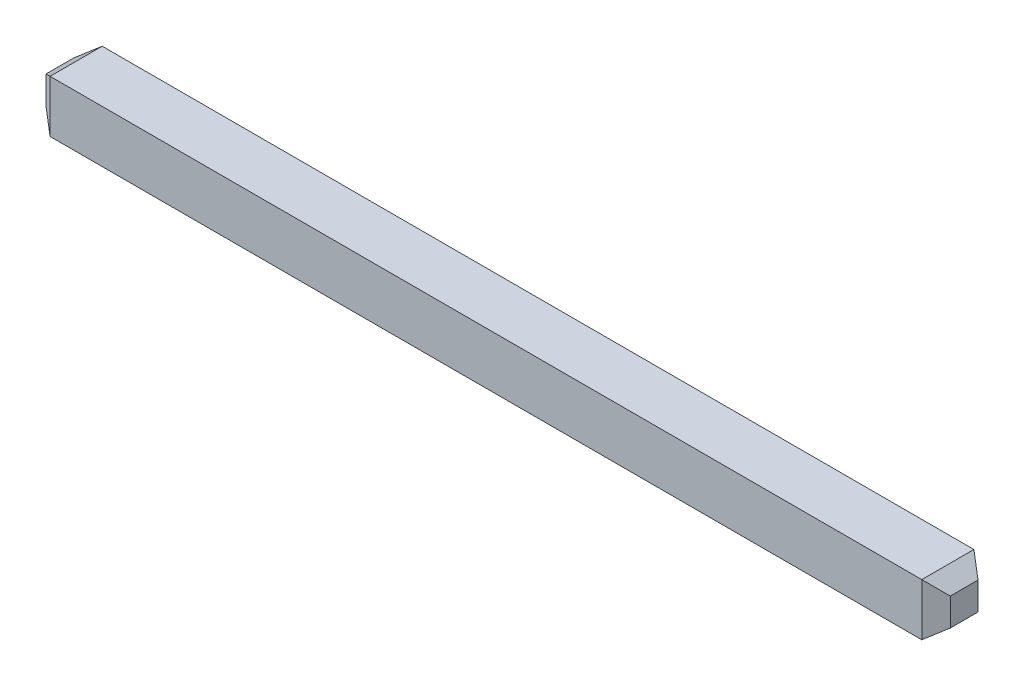
ISO-10303-21;
HEADER;
FILE_DESCRIPTION(('STEP AP214'),'2;1');
FILE_NAME('part.step','',(''),(''),'','','');
FILE_SCHEMA(('AUTOMOTIVE_DESIGN { 1 0 10303 214 1 1 1 1 }'));
ENDSEC;
DATA;
#1=APPLICATION_CONTEXT('core data for automotive mechanical design processes');
#2=APPLICATION_PROTOCOL_DEFINITION('international standard','automotive_design',2000,#1);
#3=PRODUCT_CONTEXT('',#1,'mechanical');
#4=PRODUCT('Part','Part','',(#3));
#5=PRODUCT_RELATED_PRODUCT_CATEGORY('part','',(#4));
#6=PRODUCT_DEFINITION_FORMATION('','',#4);
#7=PRODUCT_DEFINITION_CONTEXT('part definition',#1,'design');
#8=PRODUCT_DEFINITION('design','',#6,#7);
#9=PRODUCT_DEFINITION_SHAPE('','',#8);
#10=(LENGTH_UNIT() NAMED_UNIT(*) SI_UNIT(.MILLI.,.METRE.));
#11=(NAMED_UNIT(*) PLANE_ANGLE_UNIT() SI_UNIT($,.RADIAN.));
#12=(NAMED_UNIT(*) SI_UNIT($,.STERADIAN.) SOLID_ANGLE_UNIT());
#13=UNCERTAINTY_MEASURE_WITH_UNIT(LENGTH_MEASURE(1.E-05),#10,'distance_accuracy_value','');
#14=(GEOMETRIC_REPRESENTATION_CONTEXT(3) GLOBAL_UNCERTAINTY_ASSIGNED_CONTEXT((#13)) GLOBAL_UNIT_ASSIGNED_CONTEXT((#10,
#11,#12)) REPRESENTATION_CONTEXT('',''));
#15=CARTESIAN_POINT('',(0.,0.,0.));
#16=DIRECTION('',(0.,0.,1.));
#17=DIRECTION('',(1.,0.,0.));
#18=AXIS2_PLACEMENT_3D('',#15,#16,#17);
#19=CARTESIAN_POINT('',(-2.4,1.23,-24.375));
#20=DIRECTION('',(0.599999999990736,0.,0.800000000006948));
#21=DIRECTION('',(0.800000000006948,0.,-0.599999999990736));
#22=AXIS2_PLACEMENT_3D('',#19,#20,#21);
#23=PLANE('',#22);
#24=DIRECTION('',(0.,1.,0.));
#25=VECTOR('',#24,1.);
#26=CARTESIAN_POINT('',(-2.3,1.23,-24.45));
#27=LINE('',#26,#25);
#28=CARTESIAN_POINT('',(-2.29999999999957,1.55,-24.4499999999994));
#29=VERTEX_POINT('',#28);
#30=CARTESIAN_POINT('',(-2.29999999999958,0.909999999999898,-24.4499999999994));
#31=VERTEX_POINT('',#30);
#32=EDGE_CURVE('E101',#29,#31,#27,.F.);
#33=ORIENTED_EDGE('',*,*,#32,.T.);
#34=DIRECTION('',(-0.685994340569495,0.514495755428344,0.514495755427429));
#35=VECTOR('',#34,1.);
#36=CARTESIAN_POINT('',(-2.30000000000009,0.909999999999786,-24.45));
#37=LINE('',#36,#35);
#38=CARTESIAN_POINT('',(-2.50000000000021,1.06000000000001,-24.3000000000003));
#39=VERTEX_POINT('',#38);
#40=EDGE_CURVE('E85',#31,#39,#37,.T.);
#41=ORIENTED_EDGE('',*,*,#40,.T.);
#42=DIRECTION('',(0.,1.,0.));
#43=VECTOR('',#42,1.);
#44=CARTESIAN_POINT('',(-2.5,1.23,-24.3));
#45=LINE('',#44,#43);
#46=CARTESIAN_POINT('',(-2.50000000000043,1.4,-24.3000000000006));
#47=VERTEX_POINT('',#46);
#48=EDGE_CURVE('E79',#39,#47,#45,.T.);
#49=ORIENTED_EDGE('',*,*,#48,.T.);
#50=DIRECTION('',(-0.685994340570038,-0.514495755427529,0.51449575542752));
#51=VECTOR('',#50,1.);
#52=CARTESIAN_POINT('',(-2.3,1.55,-24.45));
#53=LINE('',#52,#51);
#54=EDGE_CURVE('E20',#29,#47,#53,.T.);
#55=ORIENTED_EDGE('',*,*,#54,.F.);
#56=EDGE_LOOP('',(#33,#41,#49,#55));
#57=FACE_BOUND('',#56,.T.);
#58=ADVANCED_FACE('F17',(#57),#23,.F.);
#59=CARTESIAN_POINT('',(8.5,1.23,-24.375));
#60=DIRECTION('',(-0.599999999990736,0.,0.800000000006948));
#61=DIRECTION('',(0.800000000006948,0.,0.599999999990736));
#62=AXIS2_PLACEMENT_3D('',#59,#60,#61);
#63=PLANE('',#62);
#64=DIRECTION('',(0.,1.,0.));
#65=VECTOR('',#64,1.);
#66=CARTESIAN_POINT('',(8.6,1.23,-24.3));
#67=LINE('',#66,#65);
#68=CARTESIAN_POINT('',(8.6000000000002,1.06000000000003,-24.3000000000003));
#69=VERTEX_POINT('',#68);
#70=CARTESIAN_POINT('',(8.60000000000043,1.4,-24.3000000000006));
#71=VERTEX_POINT('',#70);
#72=EDGE_CURVE('E113',#69,#71,#67,.T.);
#73=ORIENTED_EDGE('',*,*,#72,.F.);
#74=DIRECTION('',(-0.685994340569496,-0.514495755428343,-0.514495755427429));
#75=VECTOR('',#74,1.);
#76=CARTESIAN_POINT('',(8.59999999999996,1.06000000000005,-24.3));
#77=LINE('',#76,#75);
#78=CARTESIAN_POINT('',(8.39999999999959,0.909999999999884,-24.4499999999994));
#79=VERTEX_POINT('',#78);
#80=EDGE_CURVE('E108',#69,#79,#77,.T.);
#81=ORIENTED_EDGE('',*,*,#80,.T.);
#82=DIRECTION('',(0.,1.,0.));
#83=VECTOR('',#82,1.);
#84=CARTESIAN_POINT('',(8.4,1.23,-24.45));
#85=LINE('',#84,#83);
#86=CARTESIAN_POINT('',(8.39999999999957,1.55,-24.4499999999994));
#87=VERTEX_POINT('',#86);
#88=EDGE_CURVE('E99',#79,#87,#85,.T.);
#89=ORIENTED_EDGE('',*,*,#88,.T.);
#90=DIRECTION('',(-0.685994340570037,0.514495755427528,-0.514495755427522));
#91=VECTOR('',#90,1.);
#92=CARTESIAN_POINT('',(8.6,1.4,-24.3));
#93=LINE('',#92,#91);
#94=EDGE_CURVE('E116',#71,#87,#93,.T.);
#95=ORIENTED_EDGE('',*,*,#94,.F.);
#96=EDGE_LOOP('',(#73,#81,#89,#95));
#97=FACE_BOUND('',#96,.T.);
#98=ADVANCED_FACE('F214',(#97),#63,.F.);
#99=CARTESIAN_POINT('',(-2.4,1.475,-24.13));
#100=DIRECTION('',(-0.6,0.8,0.));
#101=DIRECTION('',(-0.8,-0.6,0.));
#102=AXIS2_PLACEMENT_3D('',#99,#100,#101);
#103=PLANE('',#102);
#104=DIRECTION('',(-0.685994340575954,-0.514495755427525,-0.514495755419637));
#105=VECTOR('',#104,1.);
#106=CARTESIAN_POINT('',(-2.29999999999914,1.55,-23.8100000000012));
#107=LINE('',#106,#105);
#108=CARTESIAN_POINT('',(-2.29999999999989,1.55,-23.8100000000001));
#109=VERTEX_POINT('',#108);
#110=CARTESIAN_POINT('',(-2.50000000000022,1.4,-23.9599999999997));
#111=VERTEX_POINT('',#110);
#112=EDGE_CURVE('E128',#109,#111,#107,.T.);
#113=ORIENTED_EDGE('',*,*,#112,.F.);
#114=DIRECTION('',(0.,0.,1.));
#115=VECTOR('',#114,1.);
#116=CARTESIAN_POINT('',(-2.3,1.55,-24.13));
#117=LINE('',#116,#115);
#118=EDGE_CURVE('E93',#29,#109,#117,.T.);
#119=ORIENTED_EDGE('',*,*,#118,.F.);
#120=ORIENTED_EDGE('',*,*,#54,.T.);
#121=DIRECTION('',(0.,0.,-1.));
#122=VECTOR('',#121,1.);
#123=CARTESIAN_POINT('',(-2.5,1.4,-24.13));
#124=LINE('',#123,#122);
#125=EDGE_CURVE('E87',#47,#111,#124,.F.);
#126=ORIENTED_EDGE('',*,*,#125,.T.);
#127=EDGE_LOOP('',(#113,#119,#120,#126));
#128=FACE_BOUND('',#127,.T.);
#129=ADVANCED_FACE('F90',(#128),#103,.T.);
#130=CARTESIAN_POINT('',(-2.5,1.23,-24.13));
#131=DIRECTION('',(1.,0.,0.));
#132=DIRECTION('',(0.,0.,-1.));
#133=AXIS2_PLACEMENT_3D('',#130,#131,#132);
#134=PLANE('',#133);
#135=DIRECTION('',(0.,1.,0.));
#136=VECTOR('',#135,1.);
#137=CARTESIAN_POINT('',(-2.50000000000086,1.23,-23.9599999999989));
#138=LINE('',#137,#136);
#139=CARTESIAN_POINT('',(-2.50000000000021,1.06000000000001,-23.9599999999997));
#140=VERTEX_POINT('',#139);
#141=EDGE_CURVE('E97',#111,#140,#138,.F.);
#142=ORIENTED_EDGE('',*,*,#141,.F.);
#143=ORIENTED_EDGE('',*,*,#125,.F.);
#144=ORIENTED_EDGE('',*,*,#48,.F.);
#145=DIRECTION('',(0.,0.,1.));
#146=VECTOR('',#145,1.);
#147=CARTESIAN_POINT('',(-2.49999999999996,1.06000000000005,-24.13));
#148=LINE('',#147,#146);
#149=EDGE_CURVE('E105',#39,#140,#148,.T.);
#150=ORIENTED_EDGE('',*,*,#149,.T.);
#151=EDGE_LOOP('',(#142,#143,#144,#150));
#152=FACE_BOUND('',#151,.T.);
#153=ADVANCED_FACE('F95',(#152),#134,.F.);
#154=CARTESIAN_POINT('',(3.05,1.23,-24.45));
#155=DIRECTION('',(0.,0.,1.));
#156=DIRECTION('',(1.,0.,0.));
#157=AXIS2_PLACEMENT_3D('',#154,#155,#156);
#158=PLANE('',#157);
#159=ORIENTED_EDGE('',*,*,#32,.F.);
#160=DIRECTION('',(1.,0.,0.));
#161=VECTOR('',#160,1.);
#162=CARTESIAN_POINT('',(3.05,1.55,-24.45));
#163=LINE('',#162,#161);
#164=EDGE_CURVE('E122',#87,#29,#163,.F.);
#165=ORIENTED_EDGE('',*,*,#164,.F.);
#166=ORIENTED_EDGE('',*,*,#88,.F.);
#167=DIRECTION('',(1.,0.,0.));
#168=VECTOR('',#167,1.);
#169=CARTESIAN_POINT('',(3.05,0.91,-24.45));
#170=LINE('',#169,#168);
#171=EDGE_CURVE('E136',#79,#31,#170,.F.);
#172=ORIENTED_EDGE('',*,*,#171,.T.);
#173=EDGE_LOOP('',(#159,#165,#166,#172));
#174=FACE_BOUND('',#173,.T.);
#175=ADVANCED_FACE('F182',(#174),#158,.F.);
#176=CARTESIAN_POINT('',(-2.4,0.9849999999999,-24.13));
#177=DIRECTION('',(0.600000000000912,0.799999999999316,0.));
#178=DIRECTION('',(-0.799999999999316,0.600000000000912,0.));
#179=AXIS2_PLACEMENT_3D('',#176,#177,#178);
#180=PLANE('',#179);
#181=DIRECTION('',(0.,0.,1.));
#182=VECTOR('',#181,1.);
#183=CARTESIAN_POINT('',(-2.3,0.91,-24.13));
#184=LINE('',#183,#182);
#185=CARTESIAN_POINT('',(-2.29999999999983,0.909999999999856,-23.8100000000003));
#186=VERTEX_POINT('',#185);
#187=EDGE_CURVE('E139',#31,#186,#184,.T.);
#188=ORIENTED_EDGE('',*,*,#187,.T.);
#189=DIRECTION('',(0.685994340575833,-0.514495755427777,0.514495755419546));
#190=VECTOR('',#189,1.);
#191=CARTESIAN_POINT('',(-2.50000000000086,1.06,-23.9599999999989));
#192=LINE('',#191,#190);
#193=EDGE_CURVE('E131',#140,#186,#192,.T.);
#194=ORIENTED_EDGE('',*,*,#193,.F.);
#195=ORIENTED_EDGE('',*,*,#149,.F.);
#196=ORIENTED_EDGE('',*,*,#40,.F.);
#197=EDGE_LOOP('',(#188,#194,#195,#196));
#198=FACE_BOUND('',#197,.T.);
#199=ADVANCED_FACE('F179',(#198),#180,.F.);
#200=CARTESIAN_POINT('',(8.5,0.9849999999999,-24.13));
#201=DIRECTION('',(-0.600000000000912,0.799999999999316,0.));
#202=DIRECTION('',(-0.799999999999316,-0.600000000000912,0.));
#203=AXIS2_PLACEMENT_3D('',#200,#201,#202);
#204=PLANE('',#203);
#205=DIRECTION('',(0.,0.,-1.));
#206=VECTOR('',#205,1.);
#207=CARTESIAN_POINT('',(8.6,1.06,-24.13));
#208=LINE('',#207,#206);
#209=CARTESIAN_POINT('',(8.6000000000002,1.06000000000003,-23.9599999999997));
#210=VERTEX_POINT('',#209);
#211=EDGE_CURVE('E110',#210,#69,#208,.T.);
#212=ORIENTED_EDGE('',*,*,#211,.F.);
#213=DIRECTION('',(0.685994340575833,0.514495755427777,-0.514495755419546));
#214=VECTOR('',#213,1.);
#215=CARTESIAN_POINT('',(8.39999999999914,0.9099999999999,-23.8100000000012));
#216=LINE('',#215,#214);
#217=CARTESIAN_POINT('',(8.39999999999993,0.909999999999868,-23.8100000000001));
#218=VERTEX_POINT('',#217);
#219=EDGE_CURVE('E35',#218,#210,#216,.T.);
#220=ORIENTED_EDGE('',*,*,#219,.F.);
#221=DIRECTION('',(0.,0.,1.));
#222=VECTOR('',#221,1.);
#223=CARTESIAN_POINT('',(8.4,0.91,-24.13));
#224=LINE('',#223,#222);
#225=EDGE_CURVE('E134',#218,#79,#224,.F.);
#226=ORIENTED_EDGE('',*,*,#225,.T.);
#227=ORIENTED_EDGE('',*,*,#80,.F.);
#228=EDGE_LOOP('',(#212,#220,#226,#227));
#229=FACE_BOUND('',#228,.T.);
#230=ADVANCED_FACE('F181',(#229),#204,.F.);
#231=CARTESIAN_POINT('',(8.6,1.23,-24.13));
#232=DIRECTION('',(1.,0.,0.));
#233=DIRECTION('',(0.,0.,-1.));
#234=AXIS2_PLACEMENT_3D('',#231,#232,#233);
#235=PLANE('',#234);
#236=ORIENTED_EDGE('',*,*,#72,.T.);
#237=DIRECTION('',(0.,0.,1.));
#238=VECTOR('',#237,1.);
#239=CARTESIAN_POINT('',(8.6,1.4,-24.13));
#240=LINE('',#239,#238);
#241=CARTESIAN_POINT('',(8.60000000000021,1.4,-23.9599999999997));
#242=VERTEX_POINT('',#241);
#243=EDGE_CURVE('E119',#242,#71,#240,.F.);
#244=ORIENTED_EDGE('',*,*,#243,.F.);
#245=DIRECTION('',(0.,1.,0.));
#246=VECTOR('',#245,1.);
#247=CARTESIAN_POINT('',(8.60000000000086,1.23,-23.9599999999989));
#248=LINE('',#247,#246);
#249=EDGE_CURVE('E142',#210,#242,#248,.T.);
#250=ORIENTED_EDGE('',*,*,#249,.F.);
#251=ORIENTED_EDGE('',*,*,#211,.T.);
#252=EDGE_LOOP('',(#236,#244,#250,#251));
#253=FACE_BOUND('',#252,.T.);
#254=ADVANCED_FACE('F189',(#253),#235,.T.);
#255=CARTESIAN_POINT('',(8.5,1.475,-24.13));
#256=DIRECTION('',(0.6,0.8,0.));
#257=DIRECTION('',(-0.8,0.6,0.));
#258=AXIS2_PLACEMENT_3D('',#255,#256,#257);
#259=PLANE('',#258);
#260=DIRECTION('',(-0.685994340575954,0.514495755427525,0.514495755419637));
#261=VECTOR('',#260,1.);
#262=CARTESIAN_POINT('',(8.60000000000086,1.4,-23.9599999999989));
#263=LINE('',#262,#261);
#264=CARTESIAN_POINT('',(8.39999999999989,1.55,-23.8100000000001));
#265=VERTEX_POINT('',#264);
#266=EDGE_CURVE('E145',#242,#265,#263,.T.);
#267=ORIENTED_EDGE('',*,*,#266,.F.);
#268=ORIENTED_EDGE('',*,*,#243,.T.);
#269=ORIENTED_EDGE('',*,*,#94,.T.);
#270=DIRECTION('',(0.,0.,1.));
#271=VECTOR('',#270,1.);
#272=CARTESIAN_POINT('',(8.4,1.55,-24.13));
#273=LINE('',#272,#271);
#274=EDGE_CURVE('E125',#265,#87,#273,.F.);
#275=ORIENTED_EDGE('',*,*,#274,.F.);
#276=EDGE_LOOP('',(#267,#268,#269,#275));
#277=FACE_BOUND('',#276,.T.);
#278=ADVANCED_FACE('F170',(#277),#259,.T.);
#279=CARTESIAN_POINT('',(3.05,1.55,-24.13));
#280=DIRECTION('',(0.,1.,0.));
#281=DIRECTION('',(0.,0.,1.));
#282=AXIS2_PLACEMENT_3D('',#279,#280,#281);
#283=PLANE('',#282);
#284=DIRECTION('',(1.,0.,0.));
#285=VECTOR('',#284,1.);
#286=CARTESIAN_POINT('',(3.05,1.55,-23.81));
#287=LINE('',#286,#285);
#288=EDGE_CURVE('E148',#265,#109,#287,.F.);
#289=ORIENTED_EDGE('',*,*,#288,.F.);
#290=ORIENTED_EDGE('',*,*,#274,.T.);
#291=ORIENTED_EDGE('',*,*,#164,.T.);
#292=ORIENTED_EDGE('',*,*,#118,.T.);
#293=EDGE_LOOP('',(#289,#290,#291,#292));
#294=FACE_BOUND('',#293,.T.);
#295=ADVANCED_FACE('F173',(#294),#283,.T.);
#296=CARTESIAN_POINT('',(-2.4,1.23,-23.885));
#297=DIRECTION('',(-0.5999999999908,0.,0.8000000000069));
#298=DIRECTION('',(0.8000000000069,0.,0.5999999999908));
#299=AXIS2_PLACEMENT_3D('',#296,#297,#298);
#300=PLANE('',#299);
#301=ORIENTED_EDGE('',*,*,#193,.T.);
#302=DIRECTION('',(0.,1.,0.));
#303=VECTOR('',#302,1.);
#304=CARTESIAN_POINT('',(-2.3,1.23,-23.81));
#305=LINE('',#304,#303);
#306=EDGE_CURVE('E151',#109,#186,#305,.F.);
#307=ORIENTED_EDGE('',*,*,#306,.F.);
#308=ORIENTED_EDGE('',*,*,#112,.T.);
#309=ORIENTED_EDGE('',*,*,#141,.T.);
#310=EDGE_LOOP('',(#301,#307,#308,#309));
#311=FACE_BOUND('',#310,.T.);
#312=ADVANCED_FACE('F176',(#311),#300,.T.);
#313=CARTESIAN_POINT('',(3.05,0.91,-24.13));
#314=DIRECTION('',(0.,1.,0.));
#315=DIRECTION('',(0.,0.,1.));
#316=AXIS2_PLACEMENT_3D('',#313,#314,#315);
#317=PLANE('',#316);
#318=ORIENTED_EDGE('',*,*,#187,.F.);
#319=ORIENTED_EDGE('',*,*,#171,.F.);
#320=ORIENTED_EDGE('',*,*,#225,.F.);
#321=DIRECTION('',(1.,0.,0.));
#322=VECTOR('',#321,1.);
#323=CARTESIAN_POINT('',(3.05,0.9099999999999,-23.81));
#324=LINE('',#323,#322);
#325=EDGE_CURVE('E26',#186,#218,#324,.T.);
#326=ORIENTED_EDGE('',*,*,#325,.F.);
#327=EDGE_LOOP('',(#318,#319,#320,#326));
#328=FACE_BOUND('',#327,.T.);
#329=ADVANCED_FACE('F162',(#328),#317,.F.);
#330=CARTESIAN_POINT('',(8.5,1.23,-23.885));
#331=DIRECTION('',(0.5999999999908,0.,0.8000000000069));
#332=DIRECTION('',(0.8000000000069,0.,-0.5999999999908));
#333=AXIS2_PLACEMENT_3D('',#330,#331,#332);
#334=PLANE('',#333);
#335=ORIENTED_EDGE('',*,*,#266,.T.);
#336=DIRECTION('',(0.,1.,0.));
#337=VECTOR('',#336,1.);
#338=CARTESIAN_POINT('',(8.4,1.23,-23.81));
#339=LINE('',#338,#337);
#340=EDGE_CURVE('E11',#218,#265,#339,.T.);
#341=ORIENTED_EDGE('',*,*,#340,.F.);
#342=ORIENTED_EDGE('',*,*,#219,.T.);
#343=ORIENTED_EDGE('',*,*,#249,.T.);
#344=EDGE_LOOP('',(#335,#341,#342,#343));
#345=FACE_BOUND('',#344,.T.);
#346=ADVANCED_FACE('F166',(#345),#334,.T.);
#347=CARTESIAN_POINT('',(3.05,1.23,-23.81));
#348=DIRECTION('',(0.,0.,1.));
#349=DIRECTION('',(1.,0.,0.));
#350=AXIS2_PLACEMENT_3D('',#347,#348,#349);
#351=PLANE('',#350);
#352=ORIENTED_EDGE('',*,*,#325,.T.);
#353=ORIENTED_EDGE('',*,*,#340,.T.);
#354=ORIENTED_EDGE('',*,*,#288,.T.);
#355=ORIENTED_EDGE('',*,*,#306,.T.);
#356=EDGE_LOOP('',(#352,#353,#354,#355));
#357=FACE_BOUND('',#356,.T.);
#358=ADVANCED_FACE('F157',(#357),#351,.T.);
#359=CLOSED_SHELL('',(#58,#98,#129,#153,#175,#199,#230,#254,#278,#295,#312,#329,#346,#358));
#360=MANIFOLD_SOLID_BREP('B1',#359);
#361=ADVANCED_BREP_SHAPE_REPRESENTATION('',(#18,#360),#14);
#362=SHAPE_DEFINITION_REPRESENTATION(#9,#361);
ENDSEC;
END-ISO-10303-21;
